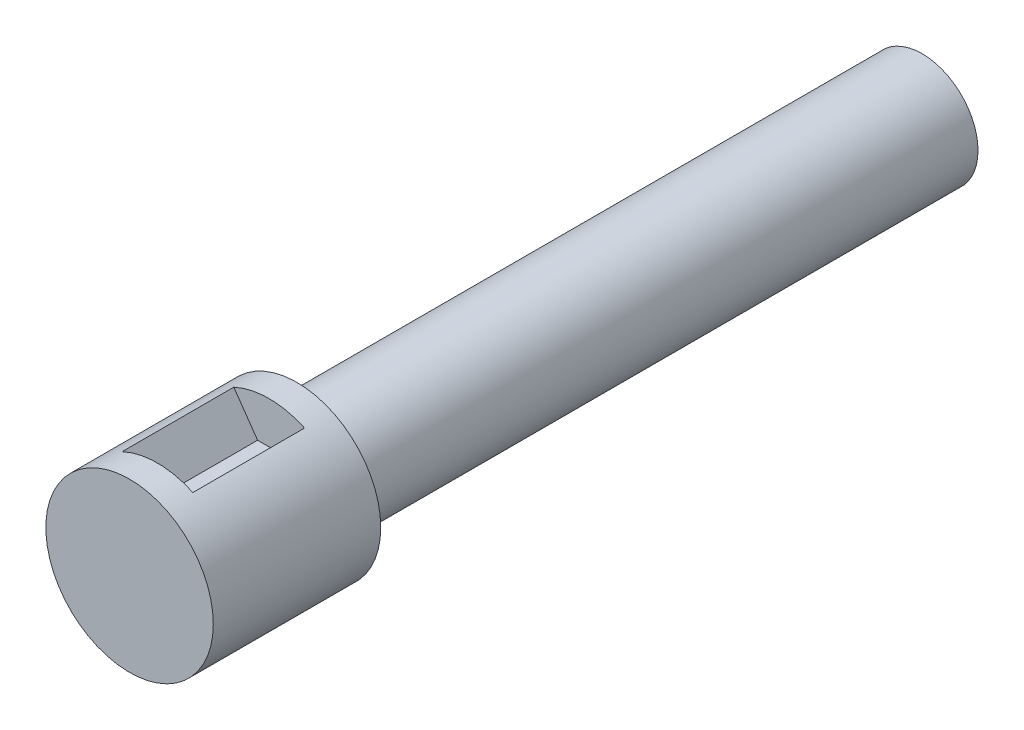
ISO-10303-21;
HEADER;
FILE_DESCRIPTION(('STEP AP214'),'2;1');
FILE_NAME('part.step','',(''),(''),'','','');
FILE_SCHEMA(('AUTOMOTIVE_DESIGN { 1 0 10303 214 1 1 1 1 }'));
ENDSEC;
DATA;
#1=APPLICATION_CONTEXT('core data for automotive mechanical design processes');
#2=APPLICATION_PROTOCOL_DEFINITION('international standard','automotive_design',2000,#1);
#3=PRODUCT_CONTEXT('',#1,'mechanical');
#4=PRODUCT('Part','Part','',(#3));
#5=PRODUCT_RELATED_PRODUCT_CATEGORY('part','',(#4));
#6=PRODUCT_DEFINITION_FORMATION('','',#4);
#7=PRODUCT_DEFINITION_CONTEXT('part definition',#1,'design');
#8=PRODUCT_DEFINITION('design','',#6,#7);
#9=PRODUCT_DEFINITION_SHAPE('','',#8);
#10=(LENGTH_UNIT() NAMED_UNIT(*) SI_UNIT(.MILLI.,.METRE.));
#11=(NAMED_UNIT(*) PLANE_ANGLE_UNIT() SI_UNIT($,.RADIAN.));
#12=(NAMED_UNIT(*) SI_UNIT($,.STERADIAN.) SOLID_ANGLE_UNIT());
#13=UNCERTAINTY_MEASURE_WITH_UNIT(LENGTH_MEASURE(1.E-05),#10,'distance_accuracy_value','');
#14=(GEOMETRIC_REPRESENTATION_CONTEXT(3) GLOBAL_UNCERTAINTY_ASSIGNED_CONTEXT((#13)) GLOBAL_UNIT_ASSIGNED_CONTEXT((#10,
#11,#12)) REPRESENTATION_CONTEXT('',''));
#15=CARTESIAN_POINT('',(0.,0.,0.));
#16=DIRECTION('',(0.,0.,1.));
#17=DIRECTION('',(1.,0.,0.));
#18=AXIS2_PLACEMENT_3D('',#15,#16,#17);
#19=CARTESIAN_POINT('',(0.,0.,19.05));
#20=DIRECTION('',(0.,0.,-1.));
#21=DIRECTION('',(-1.,0.,0.));
#22=AXIS2_PLACEMENT_3D('',#19,#20,#21);
#23=CYLINDRICAL_SURFACE('',#22,9.525);
#24=CARTESIAN_POINT('',(0.,0.,0.));
#25=DIRECTION('',(0.,0.,1.));
#26=DIRECTION('',(1.,0.,0.));
#27=AXIS2_PLACEMENT_3D('',#24,#25,#26);
#28=CIRCLE('',#27,9.525);
#29=CARTESIAN_POINT('',(9.525,0.,0.));
#30=VERTEX_POINT('',#29);
#31=EDGE_CURVE('E171',#30,#30,#28,.T.);
#32=ORIENTED_EDGE('',*,*,#31,.T.);
#33=EDGE_LOOP('',(#32));
#34=FACE_BOUND('',#33,.T.);
#35=CARTESIAN_POINT('',(0.,0.,19.05));
#36=DIRECTION('',(0.,0.,1.));
#37=DIRECTION('',(1.,0.,0.));
#38=AXIS2_PLACEMENT_3D('',#35,#36,#37);
#39=CIRCLE('',#38,9.525);
#40=CARTESIAN_POINT('',(9.525,0.,19.05));
#41=VERTEX_POINT('',#40);
#42=EDGE_CURVE('E42',#41,#41,#39,.T.);
#43=ORIENTED_EDGE('',*,*,#42,.F.);
#44=EDGE_LOOP('',(#43));
#45=FACE_BOUND('',#44,.T.);
#46=CARTESIAN_POINT('',(0.,0.,3.175));
#47=DIRECTION('',(0.,0.,1.));
#48=DIRECTION('',(1.,0.,0.));
#49=AXIS2_PLACEMENT_3D('',#46,#47,#48);
#50=CIRCLE('',#49,9.525);
#51=CARTESIAN_POINT('',(4.028330587934,8.63123268567795,3.175));
#52=VERTEX_POINT('',#51);
#53=CARTESIAN_POINT('',(-4.01980844560112,8.63520498081394,3.175));
#54=VERTEX_POINT('',#53);
#55=EDGE_CURVE('E119',#52,#54,#50,.T.);
#56=ORIENTED_EDGE('',*,*,#55,.F.);
#57=DIRECTION('',(0.,0.,1.));
#58=VECTOR('',#57,1.);
#59=CARTESIAN_POINT('',(4.028330587934,8.63123268567795,3.175));
#60=LINE('',#59,#58);
#61=CARTESIAN_POINT('',(4.028330587934,8.63123268567795,15.875));
#62=VERTEX_POINT('',#61);
#63=EDGE_CURVE('E109',#52,#62,#60,.T.);
#64=ORIENTED_EDGE('',*,*,#63,.T.);
#65=CARTESIAN_POINT('',(0.,0.,15.875));
#66=DIRECTION('',(0.,0.,1.));
#67=DIRECTION('',(1.,0.,0.));
#68=AXIS2_PLACEMENT_3D('',#65,#66,#67);
#69=CIRCLE('',#68,9.525);
#70=CARTESIAN_POINT('',(-4.01980844560112,8.63520498081394,15.875));
#71=VERTEX_POINT('',#70);
#72=EDGE_CURVE('E130',#62,#71,#69,.T.);
#73=ORIENTED_EDGE('',*,*,#72,.T.);
#74=DIRECTION('',(0.,0.,1.));
#75=VECTOR('',#74,1.);
#76=CARTESIAN_POINT('',(-4.01980844560112,8.63520498081394,3.175));
#77=LINE('',#76,#75);
#78=EDGE_CURVE('E136',#54,#71,#77,.T.);
#79=ORIENTED_EDGE('',*,*,#78,.F.);
#80=EDGE_LOOP('',(#56,#64,#73,#79));
#81=FACE_BOUND('',#80,.T.);
#82=ADVANCED_FACE('F35',(#34,#45,#81),#23,.T.);
#83=CARTESIAN_POINT('',(0.,0.,-71.12));
#84=DIRECTION('',(0.,0.,-1.));
#85=DIRECTION('',(-1.,0.,0.));
#86=AXIS2_PLACEMENT_3D('',#83,#84,#85);
#87=PLANE('',#86);
#88=CARTESIAN_POINT('',(0.,0.,-71.12));
#89=DIRECTION('',(0.,0.,-1.));
#90=DIRECTION('',(-1.,0.,0.));
#91=AXIS2_PLACEMENT_3D('',#88,#89,#90);
#92=CIRCLE('',#91,6.35);
#93=CARTESIAN_POINT('',(-6.35,0.,-71.12));
#94=VERTEX_POINT('',#93);
#95=EDGE_CURVE('E163',#94,#94,#92,.T.);
#96=ORIENTED_EDGE('',*,*,#95,.T.);
#97=EDGE_LOOP('',(#96));
#98=FACE_BOUND('',#97,.T.);
#99=CARTESIAN_POINT('',(0.,0.,-71.12));
#100=DIRECTION('',(0.,0.,-1.));
#101=DIRECTION('',(-1.,0.,0.));
#102=AXIS2_PLACEMENT_3D('',#99,#100,#101);
#103=CIRCLE('',#102,1.98882);
#104=CARTESIAN_POINT('',(1.27782197210723,1.524,-71.12));
#105=VERTEX_POINT('',#104);
#106=CARTESIAN_POINT('',(1.27782197210723,-1.524,-71.12));
#107=VERTEX_POINT('',#106);
#108=EDGE_CURVE('E153',#105,#107,#103,.T.);
#109=ORIENTED_EDGE('',*,*,#108,.F.);
#110=DIRECTION('',(-1.,0.,0.));
#111=VECTOR('',#110,1.);
#112=CARTESIAN_POINT('',(0.,1.524,-71.12));
#113=LINE('',#112,#111);
#114=CARTESIAN_POINT('',(-1.27782197210723,1.524,-71.12));
#115=VERTEX_POINT('',#114);
#116=EDGE_CURVE('E57',#105,#115,#113,.T.);
#117=ORIENTED_EDGE('',*,*,#116,.T.);
#118=CARTESIAN_POINT('',(0.,0.,-71.12));
#119=DIRECTION('',(0.,0.,-1.));
#120=DIRECTION('',(-1.,0.,0.));
#121=AXIS2_PLACEMENT_3D('',#118,#119,#120);
#122=CIRCLE('',#121,1.98882);
#123=CARTESIAN_POINT('',(-1.27782197210723,-1.524,-71.12));
#124=VERTEX_POINT('',#123);
#125=EDGE_CURVE('E142',#124,#115,#122,.T.);
#126=ORIENTED_EDGE('',*,*,#125,.F.);
#127=DIRECTION('',(-1.,0.,0.));
#128=VECTOR('',#127,1.);
#129=CARTESIAN_POINT('',(0.,-1.524,-71.12));
#130=LINE('',#129,#128);
#131=EDGE_CURVE('E156',#107,#124,#130,.T.);
#132=ORIENTED_EDGE('',*,*,#131,.F.);
#133=EDGE_LOOP('',(#109,#117,#126,#132));
#134=FACE_BOUND('',#133,.T.);
#135=ADVANCED_FACE('F190',(#98,#134),#87,.T.);
#136=CARTESIAN_POINT('',(0.,0.,19.05));
#137=DIRECTION('',(0.,0.,1.));
#138=DIRECTION('',(1.,0.,0.));
#139=AXIS2_PLACEMENT_3D('',#136,#137,#138);
#140=PLANE('',#139);
#141=ORIENTED_EDGE('',*,*,#42,.T.);
#142=EDGE_LOOP('',(#141));
#143=FACE_BOUND('',#142,.T.);
#144=ADVANCED_FACE('F181',(#143),#140,.T.);
#145=CARTESIAN_POINT('',(0.,0.,0.));
#146=DIRECTION('',(0.,0.,1.));
#147=DIRECTION('',(1.,0.,0.));
#148=AXIS2_PLACEMENT_3D('',#145,#146,#147);
#149=PLANE('',#148);
#150=CARTESIAN_POINT('',(0.,0.,0.));
#151=DIRECTION('',(0.,0.,1.));
#152=DIRECTION('',(1.,0.,0.));
#153=AXIS2_PLACEMENT_3D('',#150,#151,#152);
#154=CIRCLE('',#153,6.35);
#155=CARTESIAN_POINT('',(6.35,0.,0.));
#156=VERTEX_POINT('',#155);
#157=EDGE_CURVE('E11',#156,#156,#154,.F.);
#158=ORIENTED_EDGE('',*,*,#157,.F.);
#159=EDGE_LOOP('',(#158));
#160=FACE_BOUND('',#159,.T.);
#161=ORIENTED_EDGE('',*,*,#31,.F.);
#162=EDGE_LOOP('',(#161));
#163=FACE_BOUND('',#162,.T.);
#164=ADVANCED_FACE('F178',(#160,#163),#149,.F.);
#165=CARTESIAN_POINT('',(0.,0.,-71.12));
#166=DIRECTION('',(0.,0.,1.));
#167=DIRECTION('',(1.,0.,0.));
#168=AXIS2_PLACEMENT_3D('',#165,#166,#167);
#169=CYLINDRICAL_SURFACE('',#168,6.35);
#170=ORIENTED_EDGE('',*,*,#95,.F.);
#171=EDGE_LOOP('',(#170));
#172=FACE_BOUND('',#171,.T.);
#173=ORIENTED_EDGE('',*,*,#157,.T.);
#174=EDGE_LOOP('',(#173));
#175=FACE_BOUND('',#174,.T.);
#176=ADVANCED_FACE('F180',(#172,#175),#169,.T.);
#177=CARTESIAN_POINT('',(0.,1.524,-61.976));
#178=DIRECTION('',(0.,-1.,0.));
#179=DIRECTION('',(0.,0.,-1.));
#180=AXIS2_PLACEMENT_3D('',#177,#178,#179);
#181=PLANE('',#180);
#182=ORIENTED_EDGE('',*,*,#116,.F.);
#183=DIRECTION('',(0.,0.,-1.));
#184=VECTOR('',#183,1.);
#185=CARTESIAN_POINT('',(1.27782197210723,1.524,-61.976));
#186=LINE('',#185,#184);
#187=CARTESIAN_POINT('',(1.27782197210723,1.524,-61.976));
#188=VERTEX_POINT('',#187);
#189=EDGE_CURVE('E151',#188,#105,#186,.T.);
#190=ORIENTED_EDGE('',*,*,#189,.F.);
#191=DIRECTION('',(-1.,0.,0.));
#192=VECTOR('',#191,1.);
#193=CARTESIAN_POINT('',(0.,1.524,-61.976));
#194=LINE('',#193,#192);
#195=CARTESIAN_POINT('',(-1.27782197210723,1.524,-61.976));
#196=VERTEX_POINT('',#195);
#197=EDGE_CURVE('E139',#188,#196,#194,.T.);
#198=ORIENTED_EDGE('',*,*,#197,.T.);
#199=DIRECTION('',(0.,0.,-1.));
#200=VECTOR('',#199,1.);
#201=CARTESIAN_POINT('',(-1.27782197210723,1.524,-61.976));
#202=LINE('',#201,#200);
#203=EDGE_CURVE('E161',#196,#115,#202,.T.);
#204=ORIENTED_EDGE('',*,*,#203,.T.);
#205=EDGE_LOOP('',(#182,#190,#198,#204));
#206=FACE_BOUND('',#205,.T.);
#207=ADVANCED_FACE('F187',(#206),#181,.T.);
#208=CARTESIAN_POINT('',(0.,0.,-61.976));
#209=DIRECTION('',(0.,0.,-1.));
#210=DIRECTION('',(-1.,0.,0.));
#211=AXIS2_PLACEMENT_3D('',#208,#209,#210);
#212=CYLINDRICAL_SURFACE('',#211,1.98882);
#213=ORIENTED_EDGE('',*,*,#125,.T.);
#214=ORIENTED_EDGE('',*,*,#203,.F.);
#215=CARTESIAN_POINT('',(0.,0.,-61.976));
#216=DIRECTION('',(0.,0.,-1.));
#217=DIRECTION('',(-1.,0.,0.));
#218=AXIS2_PLACEMENT_3D('',#215,#216,#217);
#219=CIRCLE('',#218,1.98882);
#220=CARTESIAN_POINT('',(-1.27782197210723,-1.524,-61.976));
#221=VERTEX_POINT('',#220);
#222=EDGE_CURVE('E148',#221,#196,#219,.T.);
#223=ORIENTED_EDGE('',*,*,#222,.F.);
#224=DIRECTION('',(0.,0.,-1.));
#225=VECTOR('',#224,1.);
#226=CARTESIAN_POINT('',(-1.27782197210723,-1.524,-61.976));
#227=LINE('',#226,#225);
#228=EDGE_CURVE('E164',#221,#124,#227,.T.);
#229=ORIENTED_EDGE('',*,*,#228,.T.);
#230=EDGE_LOOP('',(#213,#214,#223,#229));
#231=FACE_BOUND('',#230,.T.);
#232=ADVANCED_FACE('F206',(#231),#212,.F.);
#233=CARTESIAN_POINT('',(0.,-1.524,-61.976));
#234=DIRECTION('',(0.,-1.,0.));
#235=DIRECTION('',(0.,0.,-1.));
#236=AXIS2_PLACEMENT_3D('',#233,#234,#235);
#237=PLANE('',#236);
#238=ORIENTED_EDGE('',*,*,#131,.T.);
#239=ORIENTED_EDGE('',*,*,#228,.F.);
#240=DIRECTION('',(-1.,0.,0.));
#241=VECTOR('',#240,1.);
#242=CARTESIAN_POINT('',(0.,-1.524,-61.976));
#243=LINE('',#242,#241);
#244=CARTESIAN_POINT('',(1.27782197210723,-1.524,-61.976));
#245=VERTEX_POINT('',#244);
#246=EDGE_CURVE('E145',#245,#221,#243,.T.);
#247=ORIENTED_EDGE('',*,*,#246,.F.);
#248=DIRECTION('',(0.,0.,-1.));
#249=VECTOR('',#248,1.);
#250=CARTESIAN_POINT('',(1.27782197210723,-1.524,-61.976));
#251=LINE('',#250,#249);
#252=EDGE_CURVE('E166',#245,#107,#251,.T.);
#253=ORIENTED_EDGE('',*,*,#252,.T.);
#254=EDGE_LOOP('',(#238,#239,#247,#253));
#255=FACE_BOUND('',#254,.T.);
#256=ADVANCED_FACE('F211',(#255),#237,.F.);
#257=CARTESIAN_POINT('',(0.,0.,-61.976));
#258=DIRECTION('',(0.,0.,-1.));
#259=DIRECTION('',(-1.,0.,0.));
#260=AXIS2_PLACEMENT_3D('',#257,#258,#259);
#261=CYLINDRICAL_SURFACE('',#260,1.98882);
#262=ORIENTED_EDGE('',*,*,#108,.T.);
#263=ORIENTED_EDGE('',*,*,#252,.F.);
#264=CARTESIAN_POINT('',(0.,0.,-61.976));
#265=DIRECTION('',(0.,0.,-1.));
#266=DIRECTION('',(-1.,0.,0.));
#267=AXIS2_PLACEMENT_3D('',#264,#265,#266);
#268=CIRCLE('',#267,1.98882);
#269=EDGE_CURVE('E141',#188,#245,#268,.T.);
#270=ORIENTED_EDGE('',*,*,#269,.F.);
#271=ORIENTED_EDGE('',*,*,#189,.T.);
#272=EDGE_LOOP('',(#262,#263,#270,#271));
#273=FACE_BOUND('',#272,.T.);
#274=ADVANCED_FACE('F207',(#273),#261,.F.);
#275=CARTESIAN_POINT('',(0.,0.,-61.976));
#276=DIRECTION('',(0.,0.,-1.));
#277=DIRECTION('',(-1.,0.,0.));
#278=AXIS2_PLACEMENT_3D('',#275,#276,#277);
#279=PLANE('',#278);
#280=ORIENTED_EDGE('',*,*,#197,.F.);
#281=ORIENTED_EDGE('',*,*,#269,.T.);
#282=ORIENTED_EDGE('',*,*,#246,.T.);
#283=ORIENTED_EDGE('',*,*,#222,.T.);
#284=EDGE_LOOP('',(#280,#281,#282,#283));
#285=FACE_BOUND('',#284,.T.);
#286=ADVANCED_FACE('F210',(#285),#279,.T.);
#287=CARTESIAN_POINT('',(0.,4.7625,3.175));
#288=DIRECTION('',(0.,-1.,0.));
#289=DIRECTION('',(0.,0.,-1.));
#290=AXIS2_PLACEMENT_3D('',#287,#288,#289);
#291=PLANE('',#290);
#292=DIRECTION('',(1.,0.,0.));
#293=VECTOR('',#292,1.);
#294=CARTESIAN_POINT('',(0.,4.7625,15.875));
#295=LINE('',#294,#293);
#296=CARTESIAN_POINT('',(-1.30811122477292,4.7625,15.875));
#297=VERTEX_POINT('',#296);
#298=CARTESIAN_POINT('',(1.31941479810403,4.7625,15.875));
#299=VERTEX_POINT('',#298);
#300=EDGE_CURVE('E105',#297,#299,#295,.T.);
#301=ORIENTED_EDGE('',*,*,#300,.T.);
#302=DIRECTION('',(0.,0.,1.));
#303=VECTOR('',#302,1.);
#304=CARTESIAN_POINT('',(1.31941479810403,4.7625,3.175));
#305=LINE('',#304,#303);
#306=CARTESIAN_POINT('',(1.31941479810403,4.7625,3.175));
#307=VERTEX_POINT('',#306);
#308=EDGE_CURVE('E99',#307,#299,#305,.T.);
#309=ORIENTED_EDGE('',*,*,#308,.F.);
#310=DIRECTION('',(1.,0.,0.));
#311=VECTOR('',#310,1.);
#312=CARTESIAN_POINT('',(0.,4.7625,3.175));
#313=LINE('',#312,#311);
#314=CARTESIAN_POINT('',(-1.30811122477292,4.7625,3.175));
#315=VERTEX_POINT('',#314);
#316=EDGE_CURVE('E103',#315,#307,#313,.T.);
#317=ORIENTED_EDGE('',*,*,#316,.F.);
#318=DIRECTION('',(0.,0.,1.));
#319=VECTOR('',#318,1.);
#320=CARTESIAN_POINT('',(-1.30811122477292,4.7625,3.175));
#321=LINE('',#320,#319);
#322=EDGE_CURVE('E134',#315,#297,#321,.T.);
#323=ORIENTED_EDGE('',*,*,#322,.T.);
#324=EDGE_LOOP('',(#301,#309,#317,#323));
#325=FACE_BOUND('',#324,.T.);
#326=ADVANCED_FACE('F101',(#325),#291,.F.);
#327=CARTESIAN_POINT('',(-1.30811122477292,4.7625,3.175));
#328=DIRECTION('',(-0.819152044288993,-0.573576436351044,0.));
#329=DIRECTION('',(0.573576436351044,-0.819152044288993,0.));
#330=AXIS2_PLACEMENT_3D('',#327,#328,#329);
#331=PLANE('',#330);
#332=DIRECTION('',(0.573576436351044,-0.819152044288993,0.));
#333=VECTOR('',#332,1.);
#334=CARTESIAN_POINT('',(-1.30811122477292,4.7625,15.875));
#335=LINE('',#334,#333);
#336=EDGE_CURVE('E49',#71,#297,#335,.T.);
#337=ORIENTED_EDGE('',*,*,#336,.T.);
#338=ORIENTED_EDGE('',*,*,#322,.F.);
#339=DIRECTION('',(0.573576436351044,-0.819152044288993,0.));
#340=VECTOR('',#339,1.);
#341=CARTESIAN_POINT('',(-1.30811122477292,4.7625,3.175));
#342=LINE('',#341,#340);
#343=EDGE_CURVE('E110',#54,#315,#342,.T.);
#344=ORIENTED_EDGE('',*,*,#343,.F.);
#345=ORIENTED_EDGE('',*,*,#78,.T.);
#346=EDGE_LOOP('',(#337,#338,#344,#345));
#347=FACE_BOUND('',#346,.T.);
#348=ADVANCED_FACE('F224',(#347),#331,.F.);
#349=CARTESIAN_POINT('',(1.31941479810403,4.7625,3.175));
#350=DIRECTION('',(0.819152044288993,-0.573576436351044,0.));
#351=DIRECTION('',(0.573576436351044,0.819152044288993,0.));
#352=AXIS2_PLACEMENT_3D('',#349,#350,#351);
#353=PLANE('',#352);
#354=DIRECTION('',(0.573576436351044,0.819152044288993,0.));
#355=VECTOR('',#354,1.);
#356=CARTESIAN_POINT('',(1.31941479810403,4.7625,15.875));
#357=LINE('',#356,#355);
#358=EDGE_CURVE('E128',#299,#62,#357,.T.);
#359=ORIENTED_EDGE('',*,*,#358,.T.);
#360=ORIENTED_EDGE('',*,*,#63,.F.);
#361=DIRECTION('',(0.573576436351044,0.819152044288993,0.));
#362=VECTOR('',#361,1.);
#363=CARTESIAN_POINT('',(1.31941479810403,4.7625,3.175));
#364=LINE('',#363,#362);
#365=EDGE_CURVE('E113',#307,#52,#364,.T.);
#366=ORIENTED_EDGE('',*,*,#365,.F.);
#367=ORIENTED_EDGE('',*,*,#308,.T.);
#368=EDGE_LOOP('',(#359,#360,#366,#367));
#369=FACE_BOUND('',#368,.T.);
#370=ADVANCED_FACE('F114',(#369),#353,.F.);
#371=CARTESIAN_POINT('',(0.,0.,3.175));
#372=DIRECTION('',(0.,0.,1.));
#373=DIRECTION('',(1.,0.,0.));
#374=AXIS2_PLACEMENT_3D('',#371,#372,#373);
#375=PLANE('',#374);
#376=ORIENTED_EDGE('',*,*,#316,.T.);
#377=ORIENTED_EDGE('',*,*,#365,.T.);
#378=ORIENTED_EDGE('',*,*,#55,.T.);
#379=ORIENTED_EDGE('',*,*,#343,.T.);
#380=EDGE_LOOP('',(#376,#377,#378,#379));
#381=FACE_BOUND('',#380,.T.);
#382=ADVANCED_FACE('F122',(#381),#375,.T.);
#383=CARTESIAN_POINT('',(0.,0.,15.875));
#384=DIRECTION('',(0.,0.,1.));
#385=DIRECTION('',(1.,0.,0.));
#386=AXIS2_PLACEMENT_3D('',#383,#384,#385);
#387=PLANE('',#386);
#388=ORIENTED_EDGE('',*,*,#300,.F.);
#389=ORIENTED_EDGE('',*,*,#336,.F.);
#390=ORIENTED_EDGE('',*,*,#72,.F.);
#391=ORIENTED_EDGE('',*,*,#358,.F.);
#392=EDGE_LOOP('',(#388,#389,#390,#391));
#393=FACE_BOUND('',#392,.T.);
#394=ADVANCED_FACE('F230',(#393),#387,.F.);
#395=CLOSED_SHELL('',(#82,#135,#144,#164,#176,#207,#232,#256,#274,#286,#326,#348,#370,#382,#394));
#396=MANIFOLD_SOLID_BREP('B2',#395);
#397=ADVANCED_BREP_SHAPE_REPRESENTATION('',(#18,#396),#14);
#398=SHAPE_DEFINITION_REPRESENTATION(#9,#397);
ENDSEC;
END-ISO-10303-21;
